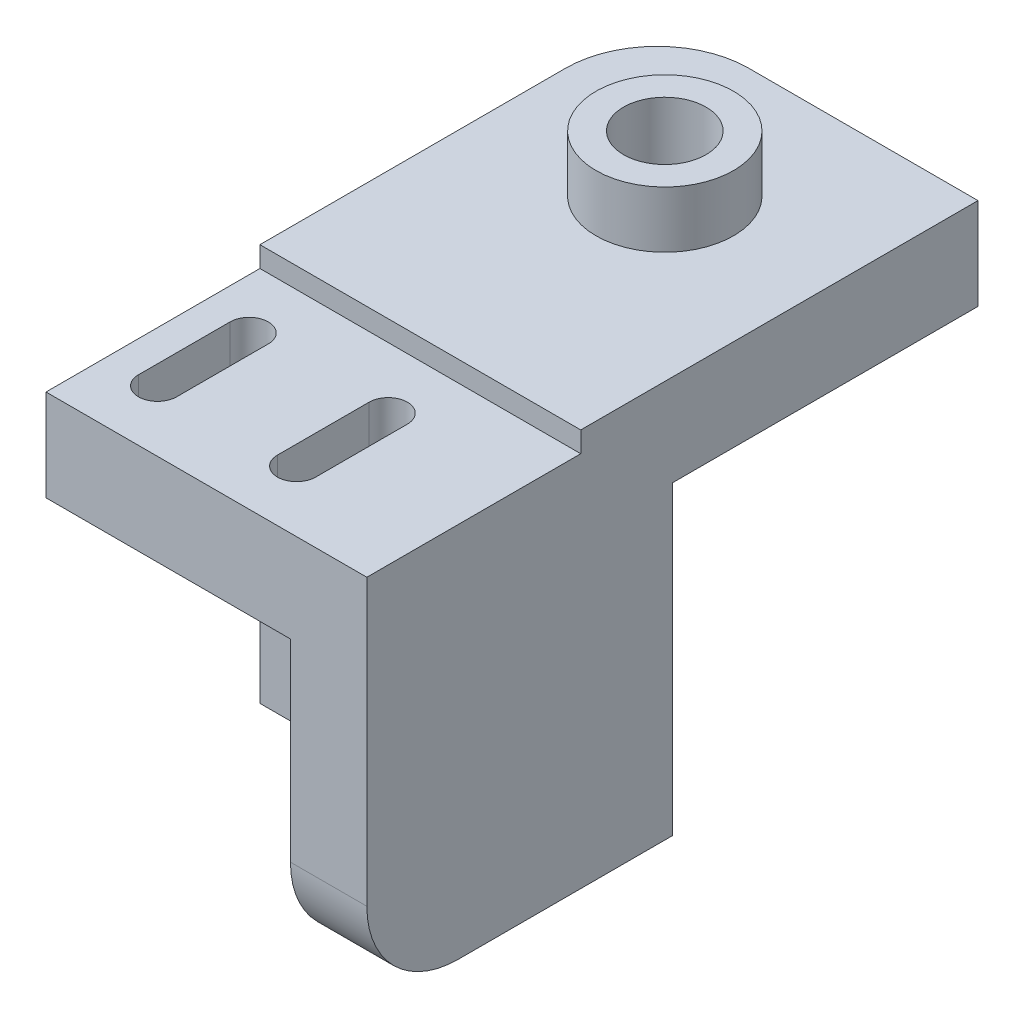
ISO-10303-21;
HEADER;
FILE_DESCRIPTION(('STEP AP214'),'2;1');
FILE_NAME('part.step','',(''),(''),'','','');
FILE_SCHEMA(('AUTOMOTIVE_DESIGN { 1 0 10303 214 1 1 1 1 }'));
ENDSEC;
DATA;
#1=APPLICATION_CONTEXT('core data for automotive mechanical design processes');
#2=APPLICATION_PROTOCOL_DEFINITION('international standard','automotive_design',2000,#1);
#3=PRODUCT_CONTEXT('',#1,'mechanical');
#4=PRODUCT('Part','Part','',(#3));
#5=PRODUCT_RELATED_PRODUCT_CATEGORY('part','',(#4));
#6=PRODUCT_DEFINITION_FORMATION('','',#4);
#7=PRODUCT_DEFINITION_CONTEXT('part definition',#1,'design');
#8=PRODUCT_DEFINITION('design','',#6,#7);
#9=PRODUCT_DEFINITION_SHAPE('','',#8);
#10=(LENGTH_UNIT() NAMED_UNIT(*) SI_UNIT(.MILLI.,.METRE.));
#11=(NAMED_UNIT(*) PLANE_ANGLE_UNIT() SI_UNIT($,.RADIAN.));
#12=(NAMED_UNIT(*) SI_UNIT($,.STERADIAN.) SOLID_ANGLE_UNIT());
#13=UNCERTAINTY_MEASURE_WITH_UNIT(LENGTH_MEASURE(1.E-05),#10,'distance_accuracy_value','');
#14=(GEOMETRIC_REPRESENTATION_CONTEXT(3) GLOBAL_UNCERTAINTY_ASSIGNED_CONTEXT((#13)) GLOBAL_UNIT_ASSIGNED_CONTEXT((#10,
#11,#12)) REPRESENTATION_CONTEXT('',''));
#15=CARTESIAN_POINT('',(0.,0.,0.));
#16=DIRECTION('',(0.,0.,1.));
#17=DIRECTION('',(1.,0.,0.));
#18=AXIS2_PLACEMENT_3D('',#15,#16,#17);
#19=CARTESIAN_POINT('',(0.,0.,6.));
#20=DIRECTION('',(0.,0.,1.));
#21=DIRECTION('',(1.,0.,0.));
#22=AXIS2_PLACEMENT_3D('',#19,#20,#21);
#23=PLANE('',#22);
#24=CARTESIAN_POINT('',(8.,10.,6.));
#25=DIRECTION('',(0.,0.,1.));
#26=DIRECTION('',(1.,0.,0.));
#27=AXIS2_PLACEMENT_3D('',#24,#25,#26);
#28=CIRCLE('',#27,2.7);
#29=CARTESIAN_POINT('',(10.7,10.,6.));
#30=VERTEX_POINT('',#29);
#31=EDGE_CURVE('E283',#30,#30,#28,.T.);
#32=ORIENTED_EDGE('',*,*,#31,.F.);
#33=EDGE_LOOP('',(#32));
#34=FACE_BOUND('',#33,.T.);
#35=DIRECTION('',(1.,0.,0.));
#36=VECTOR('',#35,1.);
#37=CARTESIAN_POINT('',(0.,0.,6.));
#38=LINE('',#37,#36);
#39=CARTESIAN_POINT('',(0.,0.,6.));
#40=VERTEX_POINT('',#39);
#41=CARTESIAN_POINT('',(16.,0.,6.));
#42=VERTEX_POINT('',#41);
#43=EDGE_CURVE('E270',#40,#42,#38,.T.);
#44=ORIENTED_EDGE('',*,*,#43,.T.);
#45=DIRECTION('',(0.,-1.,0.));
#46=VECTOR('',#45,1.);
#47=CARTESIAN_POINT('',(16.,0.,6.));
#48=LINE('',#47,#46);
#49=CARTESIAN_POINT('',(16.,18.65,6.));
#50=VERTEX_POINT('',#49);
#51=EDGE_CURVE('E189',#50,#42,#48,.T.);
#52=ORIENTED_EDGE('',*,*,#51,.F.);
#53=DIRECTION('',(1.,0.,0.));
#54=VECTOR('',#53,1.);
#55=CARTESIAN_POINT('',(0.,18.65,6.));
#56=LINE('',#55,#54);
#57=CARTESIAN_POINT('',(0.,18.65,6.));
#58=VERTEX_POINT('',#57);
#59=EDGE_CURVE('E197',#58,#50,#56,.T.);
#60=ORIENTED_EDGE('',*,*,#59,.F.);
#61=DIRECTION('',(0.,1.,0.));
#62=VECTOR('',#61,1.);
#63=CARTESIAN_POINT('',(0.,0.,6.));
#64=LINE('',#63,#62);
#65=EDGE_CURVE('E267',#40,#58,#64,.T.);
#66=ORIENTED_EDGE('',*,*,#65,.F.);
#67=EDGE_LOOP('',(#44,#52,#60,#66));
#68=FACE_BOUND('',#67,.T.);
#69=ADVANCED_FACE('F37',(#34,#68),#23,.T.);
#70=CARTESIAN_POINT('',(0.,18.65,20.));
#71=DIRECTION('',(0.,1.,0.));
#72=DIRECTION('',(0.,0.,1.));
#73=AXIS2_PLACEMENT_3D('',#70,#71,#72);
#74=PLANE('',#73);
#75=DIRECTION('',(0.,0.,1.));
#76=VECTOR('',#75,1.);
#77=CARTESIAN_POINT('',(2.05,18.65,20.));
#78=LINE('',#77,#76);
#79=CARTESIAN_POINT('',(2.05,18.65,10.));
#80=VERTEX_POINT('',#79);
#81=CARTESIAN_POINT('',(2.05,18.65,16.));
#82=VERTEX_POINT('',#81);
#83=EDGE_CURVE('E411',#80,#82,#78,.T.);
#84=ORIENTED_EDGE('',*,*,#83,.T.);
#85=CARTESIAN_POINT('',(3.3,18.65,16.));
#86=DIRECTION('',(0.,1.,0.));
#87=DIRECTION('',(0.,0.,1.));
#88=AXIS2_PLACEMENT_3D('',#85,#86,#87);
#89=CIRCLE('',#88,1.25);
#90=CARTESIAN_POINT('',(4.55,18.65,16.));
#91=VERTEX_POINT('',#90);
#92=EDGE_CURVE('E221',#82,#91,#89,.T.);
#93=ORIENTED_EDGE('',*,*,#92,.T.);
#94=DIRECTION('',(0.,0.,-1.));
#95=VECTOR('',#94,1.);
#96=CARTESIAN_POINT('',(4.55,18.65,20.));
#97=LINE('',#96,#95);
#98=CARTESIAN_POINT('',(4.55,18.65,10.));
#99=VERTEX_POINT('',#98);
#100=EDGE_CURVE('E399',#91,#99,#97,.T.);
#101=ORIENTED_EDGE('',*,*,#100,.T.);
#102=CARTESIAN_POINT('',(3.3,18.65,10.));
#103=DIRECTION('',(0.,1.,0.));
#104=DIRECTION('',(0.,0.,1.));
#105=AXIS2_PLACEMENT_3D('',#102,#103,#104);
#106=CIRCLE('',#105,1.25);
#107=EDGE_CURVE('E408',#99,#80,#106,.T.);
#108=ORIENTED_EDGE('',*,*,#107,.T.);
#109=EDGE_LOOP('',(#84,#93,#101,#108));
#110=FACE_BOUND('',#109,.T.);
#111=DIRECTION('',(0.,0.,1.));
#112=VECTOR('',#111,1.);
#113=CARTESIAN_POINT('',(11.15,18.65,20.));
#114=LINE('',#113,#112);
#115=CARTESIAN_POINT('',(11.15,18.65,10.));
#116=VERTEX_POINT('',#115);
#117=CARTESIAN_POINT('',(11.15,18.65,16.));
#118=VERTEX_POINT('',#117);
#119=EDGE_CURVE('E379',#116,#118,#114,.T.);
#120=ORIENTED_EDGE('',*,*,#119,.T.);
#121=CARTESIAN_POINT('',(12.4,18.65,16.));
#122=DIRECTION('',(0.,1.,0.));
#123=DIRECTION('',(0.,0.,1.));
#124=AXIS2_PLACEMENT_3D('',#121,#122,#123);
#125=CIRCLE('',#124,1.25);
#126=CARTESIAN_POINT('',(13.65,18.65,16.));
#127=VERTEX_POINT('',#126);
#128=EDGE_CURVE('E382',#118,#127,#125,.T.);
#129=ORIENTED_EDGE('',*,*,#128,.T.);
#130=DIRECTION('',(0.,0.,-1.));
#131=VECTOR('',#130,1.);
#132=CARTESIAN_POINT('',(13.65,18.65,20.));
#133=LINE('',#132,#131);
#134=CARTESIAN_POINT('',(13.65,18.65,10.));
#135=VERTEX_POINT('',#134);
#136=EDGE_CURVE('E367',#127,#135,#133,.T.);
#137=ORIENTED_EDGE('',*,*,#136,.T.);
#138=CARTESIAN_POINT('',(12.4,18.65,10.));
#139=DIRECTION('',(0.,1.,0.));
#140=DIRECTION('',(0.,0.,1.));
#141=AXIS2_PLACEMENT_3D('',#138,#139,#140);
#142=CIRCLE('',#141,1.25);
#143=EDGE_CURVE('E376',#135,#116,#142,.T.);
#144=ORIENTED_EDGE('',*,*,#143,.T.);
#145=EDGE_LOOP('',(#120,#129,#137,#144));
#146=FACE_BOUND('',#145,.T.);
#147=DIRECTION('',(0.,0.,-1.));
#148=VECTOR('',#147,1.);
#149=CARTESIAN_POINT('',(16.,18.65,20.));
#150=LINE('',#149,#148);
#151=CARTESIAN_POINT('',(16.,18.65,20.));
#152=VERTEX_POINT('',#151);
#153=EDGE_CURVE('E181',#152,#50,#150,.T.);
#154=ORIENTED_EDGE('',*,*,#153,.F.);
#155=DIRECTION('',(1.,0.,0.));
#156=VECTOR('',#155,1.);
#157=CARTESIAN_POINT('',(0.,18.65,20.));
#158=LINE('',#157,#156);
#159=CARTESIAN_POINT('',(0.,18.65,20.));
#160=VERTEX_POINT('',#159);
#161=EDGE_CURVE('E195',#160,#152,#158,.T.);
#162=ORIENTED_EDGE('',*,*,#161,.F.);
#163=DIRECTION('',(0.,0.,-1.));
#164=VECTOR('',#163,1.);
#165=CARTESIAN_POINT('',(0.,18.65,20.));
#166=LINE('',#165,#164);
#167=EDGE_CURVE('E225',#160,#58,#166,.T.);
#168=ORIENTED_EDGE('',*,*,#167,.T.);
#169=ORIENTED_EDGE('',*,*,#59,.T.);
#170=EDGE_LOOP('',(#154,#162,#168,#169));
#171=FACE_BOUND('',#170,.T.);
#172=ADVANCED_FACE('F193',(#110,#146,#171),#74,.F.);
#173=CARTESIAN_POINT('',(0.,26.,6.));
#174=DIRECTION('',(0.,1.,0.));
#175=DIRECTION('',(0.,0.,1.));
#176=AXIS2_PLACEMENT_3D('',#173,#174,#175);
#177=PLANE('',#176);
#178=DIRECTION('',(1.,0.,0.));
#179=VECTOR('',#178,1.);
#180=CARTESIAN_POINT('',(21.,26.,-20.));
#181=LINE('',#180,#179);
#182=CARTESIAN_POINT('',(6.,26.,-20.));
#183=VERTEX_POINT('',#182);
#184=CARTESIAN_POINT('',(21.,26.,-20.));
#185=VERTEX_POINT('',#184);
#186=EDGE_CURVE('E252',#183,#185,#181,.T.);
#187=ORIENTED_EDGE('',*,*,#186,.F.);
#188=CARTESIAN_POINT('',(6.,26.,-14.));
#189=DIRECTION('',(0.,1.,0.));
#190=DIRECTION('',(0.,0.,1.));
#191=AXIS2_PLACEMENT_3D('',#188,#189,#190);
#192=CIRCLE('',#191,6.);
#193=CARTESIAN_POINT('',(0.,26.,-14.));
#194=VERTEX_POINT('',#193);
#195=EDGE_CURVE('E244',#183,#194,#192,.T.);
#196=ORIENTED_EDGE('',*,*,#195,.T.);
#197=DIRECTION('',(0.,0.,-1.));
#198=VECTOR('',#197,1.);
#199=CARTESIAN_POINT('',(0.,26.,6.));
#200=LINE('',#199,#198);
#201=CARTESIAN_POINT('',(0.,26.,6.));
#202=VERTEX_POINT('',#201);
#203=EDGE_CURVE('E286',#202,#194,#200,.T.);
#204=ORIENTED_EDGE('',*,*,#203,.F.);
#205=DIRECTION('',(1.,0.,0.));
#206=VECTOR('',#205,1.);
#207=CARTESIAN_POINT('',(0.,26.,6.));
#208=LINE('',#207,#206);
#209=CARTESIAN_POINT('',(21.,26.,6.));
#210=VERTEX_POINT('',#209);
#211=EDGE_CURVE('E280',#202,#210,#208,.T.);
#212=ORIENTED_EDGE('',*,*,#211,.T.);
#213=DIRECTION('',(0.,0.,-1.));
#214=VECTOR('',#213,1.);
#215=CARTESIAN_POINT('',(21.,26.,6.));
#216=LINE('',#215,#214);
#217=EDGE_CURVE('E304',#210,#185,#216,.T.);
#218=ORIENTED_EDGE('',*,*,#217,.T.);
#219=EDGE_LOOP('',(#187,#196,#204,#212,#218));
#220=FACE_BOUND('',#219,.T.);
#221=CARTESIAN_POINT('',(10.5,26.,-10.));
#222=DIRECTION('',(0.,1.,0.));
#223=DIRECTION('',(0.,0.,1.));
#224=AXIS2_PLACEMENT_3D('',#221,#222,#223);
#225=CIRCLE('',#224,4.5);
#226=CARTESIAN_POINT('',(10.5,26.,-5.5));
#227=VERTEX_POINT('',#226);
#228=EDGE_CURVE('E347',#227,#227,#225,.T.);
#229=ORIENTED_EDGE('',*,*,#228,.F.);
#230=EDGE_LOOP('',(#229));
#231=FACE_BOUND('',#230,.T.);
#232=ADVANCED_FACE('F449',(#220,#231),#177,.T.);
#233=DIRECTION('',(-1.,0.,0.));
#234=VECTOR('',#233,1.);
#235=CARTESIAN_POINT('',(0.,24.65,6.));
#236=LINE('',#235,#234);
#237=CARTESIAN_POINT('',(21.,24.65,6.));
#238=VERTEX_POINT('',#237);
#239=CARTESIAN_POINT('',(0.,24.65,6.));
#240=VERTEX_POINT('',#239);
#241=EDGE_CURVE('E208',#238,#240,#236,.T.);
#242=ORIENTED_EDGE('',*,*,#241,.F.);
#243=DIRECTION('',(0.,1.,0.));
#244=VECTOR('',#243,1.);
#245=CARTESIAN_POINT('',(21.,0.,6.));
#246=LINE('',#245,#244);
#247=EDGE_CURVE('E222',#238,#210,#246,.T.);
#248=ORIENTED_EDGE('',*,*,#247,.T.);
#249=ORIENTED_EDGE('',*,*,#211,.F.);
#250=EDGE_CURVE('E271',#240,#202,#64,.T.);
#251=ORIENTED_EDGE('',*,*,#250,.F.);
#252=EDGE_LOOP('',(#242,#248,#249,#251));
#253=FACE_BOUND('',#252,.T.);
#254=ADVANCED_FACE('F445',(#253),#23,.T.);
#255=CARTESIAN_POINT('',(0.,0.,0.));
#256=DIRECTION('',(0.,0.,1.));
#257=DIRECTION('',(1.,0.,0.));
#258=AXIS2_PLACEMENT_3D('',#255,#256,#257);
#259=PLANE('',#258);
#260=CARTESIAN_POINT('',(8.,10.,0.));
#261=DIRECTION('',(0.,0.,1.));
#262=DIRECTION('',(1.,0.,0.));
#263=AXIS2_PLACEMENT_3D('',#260,#261,#262);
#264=CIRCLE('',#263,2.7);
#265=CARTESIAN_POINT('',(10.7,10.,0.));
#266=VERTEX_POINT('',#265);
#267=EDGE_CURVE('E297',#266,#266,#264,.T.);
#268=ORIENTED_EDGE('',*,*,#267,.T.);
#269=EDGE_LOOP('',(#268));
#270=FACE_BOUND('',#269,.T.);
#271=DIRECTION('',(-1.,0.,0.));
#272=VECTOR('',#271,1.);
#273=CARTESIAN_POINT('',(21.,20.,0.));
#274=LINE('',#273,#272);
#275=CARTESIAN_POINT('',(21.,20.,0.));
#276=VERTEX_POINT('',#275);
#277=CARTESIAN_POINT('',(0.,20.,0.));
#278=VERTEX_POINT('',#277);
#279=EDGE_CURVE('E257',#276,#278,#274,.T.);
#280=ORIENTED_EDGE('',*,*,#279,.F.);
#281=DIRECTION('',(0.,1.,0.));
#282=VECTOR('',#281,1.);
#283=CARTESIAN_POINT('',(21.,0.,0.));
#284=LINE('',#283,#282);
#285=CARTESIAN_POINT('',(21.,0.,0.));
#286=VERTEX_POINT('',#285);
#287=EDGE_CURVE('E295',#286,#276,#284,.T.);
#288=ORIENTED_EDGE('',*,*,#287,.F.);
#289=DIRECTION('',(1.,0.,0.));
#290=VECTOR('',#289,1.);
#291=CARTESIAN_POINT('',(0.,0.,0.));
#292=LINE('',#291,#290);
#293=CARTESIAN_POINT('',(0.,0.,0.));
#294=VERTEX_POINT('',#293);
#295=EDGE_CURVE('E289',#294,#286,#292,.T.);
#296=ORIENTED_EDGE('',*,*,#295,.F.);
#297=DIRECTION('',(0.,1.,0.));
#298=VECTOR('',#297,1.);
#299=CARTESIAN_POINT('',(0.,0.,0.));
#300=LINE('',#299,#298);
#301=EDGE_CURVE('E262',#294,#278,#300,.T.);
#302=ORIENTED_EDGE('',*,*,#301,.T.);
#303=EDGE_LOOP('',(#280,#288,#296,#302));
#304=FACE_BOUND('',#303,.T.);
#305=ADVANCED_FACE('F316',(#270,#304),#259,.F.);
#306=CARTESIAN_POINT('',(0.,0.,6.));
#307=DIRECTION('',(-1.,0.,0.));
#308=DIRECTION('',(0.,0.,1.));
#309=AXIS2_PLACEMENT_3D('',#306,#307,#308);
#310=PLANE('',#309);
#311=ORIENTED_EDGE('',*,*,#203,.T.);
#312=DIRECTION('',(0.,1.,0.));
#313=VECTOR('',#312,1.);
#314=CARTESIAN_POINT('',(0.,0.,-14.));
#315=LINE('',#314,#313);
#316=CARTESIAN_POINT('',(0.,20.,-14.));
#317=VERTEX_POINT('',#316);
#318=EDGE_CURVE('E247',#194,#317,#315,.F.);
#319=ORIENTED_EDGE('',*,*,#318,.T.);
#320=DIRECTION('',(0.,0.,1.));
#321=VECTOR('',#320,1.);
#322=CARTESIAN_POINT('',(0.,20.,-20.));
#323=LINE('',#322,#321);
#324=EDGE_CURVE('E248',#317,#278,#323,.T.);
#325=ORIENTED_EDGE('',*,*,#324,.T.);
#326=ORIENTED_EDGE('',*,*,#301,.F.);
#327=DIRECTION('',(0.,0.,-1.));
#328=VECTOR('',#327,1.);
#329=CARTESIAN_POINT('',(0.,0.,6.));
#330=LINE('',#329,#328);
#331=EDGE_CURVE('E245',#40,#294,#330,.T.);
#332=ORIENTED_EDGE('',*,*,#331,.F.);
#333=ORIENTED_EDGE('',*,*,#65,.T.);
#334=ORIENTED_EDGE('',*,*,#167,.F.);
#335=DIRECTION('',(0.,-1.,0.));
#336=VECTOR('',#335,1.);
#337=CARTESIAN_POINT('',(0.,18.65,20.));
#338=LINE('',#337,#336);
#339=CARTESIAN_POINT('',(0.,24.65,20.));
#340=VERTEX_POINT('',#339);
#341=EDGE_CURVE('E202',#340,#160,#338,.T.);
#342=ORIENTED_EDGE('',*,*,#341,.F.);
#343=DIRECTION('',(0.,0.,-1.));
#344=VECTOR('',#343,1.);
#345=CARTESIAN_POINT('',(0.,24.65,20.));
#346=LINE('',#345,#344);
#347=EDGE_CURVE('E213',#340,#240,#346,.T.);
#348=ORIENTED_EDGE('',*,*,#347,.T.);
#349=ORIENTED_EDGE('',*,*,#250,.T.);
#350=EDGE_LOOP('',(#311,#319,#325,#326,#332,#333,#334,#342,#348,#349));
#351=FACE_BOUND('',#350,.T.);
#352=ADVANCED_FACE('F318',(#351),#310,.T.);
#353=CARTESIAN_POINT('',(0.,0.,6.));
#354=DIRECTION('',(0.,1.,0.));
#355=DIRECTION('',(0.,0.,1.));
#356=AXIS2_PLACEMENT_3D('',#353,#354,#355);
#357=PLANE('',#356);
#358=DIRECTION('',(0.,0.,-1.));
#359=VECTOR('',#358,1.);
#360=CARTESIAN_POINT('',(21.,0.,6.));
#361=LINE('',#360,#359);
#362=CARTESIAN_POINT('',(21.,0.,14.));
#363=VERTEX_POINT('',#362);
#364=EDGE_CURVE('E306',#363,#286,#361,.T.);
#365=ORIENTED_EDGE('',*,*,#364,.F.);
#366=DIRECTION('',(1.,0.,0.));
#367=VECTOR('',#366,1.);
#368=CARTESIAN_POINT('',(0.,0.,14.));
#369=LINE('',#368,#367);
#370=CARTESIAN_POINT('',(16.,0.,14.));
#371=VERTEX_POINT('',#370);
#372=EDGE_CURVE('E45',#363,#371,#369,.F.);
#373=ORIENTED_EDGE('',*,*,#372,.T.);
#374=DIRECTION('',(0.,0.,-1.));
#375=VECTOR('',#374,1.);
#376=CARTESIAN_POINT('',(16.,0.,20.));
#377=LINE('',#376,#375);
#378=EDGE_CURVE('E188',#371,#42,#377,.T.);
#379=ORIENTED_EDGE('',*,*,#378,.T.);
#380=ORIENTED_EDGE('',*,*,#43,.F.);
#381=ORIENTED_EDGE('',*,*,#331,.T.);
#382=ORIENTED_EDGE('',*,*,#295,.T.);
#383=EDGE_LOOP('',(#365,#373,#379,#380,#381,#382));
#384=FACE_BOUND('',#383,.T.);
#385=ADVANCED_FACE('F310',(#384),#357,.F.);
#386=CARTESIAN_POINT('',(21.,0.,6.));
#387=DIRECTION('',(-1.,0.,0.));
#388=DIRECTION('',(0.,0.,1.));
#389=AXIS2_PLACEMENT_3D('',#386,#387,#388);
#390=PLANE('',#389);
#391=DIRECTION('',(0.,1.,0.));
#392=VECTOR('',#391,1.);
#393=CARTESIAN_POINT('',(21.,18.65,20.));
#394=LINE('',#393,#392);
#395=CARTESIAN_POINT('',(21.,6.,20.));
#396=VERTEX_POINT('',#395);
#397=CARTESIAN_POINT('',(21.,24.65,20.));
#398=VERTEX_POINT('',#397);
#399=EDGE_CURVE('E204',#396,#398,#394,.T.);
#400=ORIENTED_EDGE('',*,*,#399,.F.);
#401=CARTESIAN_POINT('',(21.,6.,14.));
#402=DIRECTION('',(-1.,0.,0.));
#403=DIRECTION('',(0.,0.,1.));
#404=AXIS2_PLACEMENT_3D('',#401,#402,#403);
#405=CIRCLE('',#404,6.);
#406=EDGE_CURVE('E59',#396,#363,#405,.F.);
#407=ORIENTED_EDGE('',*,*,#406,.T.);
#408=ORIENTED_EDGE('',*,*,#364,.T.);
#409=ORIENTED_EDGE('',*,*,#287,.T.);
#410=DIRECTION('',(0.,0.,1.));
#411=VECTOR('',#410,1.);
#412=CARTESIAN_POINT('',(21.,20.,-20.));
#413=LINE('',#412,#411);
#414=CARTESIAN_POINT('',(21.,20.,-20.));
#415=VERTEX_POINT('',#414);
#416=EDGE_CURVE('E251',#415,#276,#413,.T.);
#417=ORIENTED_EDGE('',*,*,#416,.F.);
#418=DIRECTION('',(0.,-1.,0.));
#419=VECTOR('',#418,1.);
#420=CARTESIAN_POINT('',(21.,26.,-20.));
#421=LINE('',#420,#419);
#422=EDGE_CURVE('E472',#185,#415,#421,.T.);
#423=ORIENTED_EDGE('',*,*,#422,.F.);
#424=ORIENTED_EDGE('',*,*,#217,.F.);
#425=ORIENTED_EDGE('',*,*,#247,.F.);
#426=DIRECTION('',(0.,0.,-1.));
#427=VECTOR('',#426,1.);
#428=CARTESIAN_POINT('',(21.,24.65,20.));
#429=LINE('',#428,#427);
#430=EDGE_CURVE('E228',#398,#238,#429,.T.);
#431=ORIENTED_EDGE('',*,*,#430,.F.);
#432=EDGE_LOOP('',(#400,#407,#408,#409,#417,#423,#424,#425,#431));
#433=FACE_BOUND('',#432,.T.);
#434=ADVANCED_FACE('F334',(#433),#390,.F.);
#435=CARTESIAN_POINT('',(8.,10.,6.));
#436=DIRECTION('',(0.,0.,-1.));
#437=DIRECTION('',(-1.,0.,0.));
#438=AXIS2_PLACEMENT_3D('',#435,#436,#437);
#439=CYLINDRICAL_SURFACE('',#438,2.7);
#440=ORIENTED_EDGE('',*,*,#31,.T.);
#441=EDGE_LOOP('',(#440));
#442=FACE_BOUND('',#441,.T.);
#443=ORIENTED_EDGE('',*,*,#267,.F.);
#444=EDGE_LOOP('',(#443));
#445=FACE_BOUND('',#444,.T.);
#446=ADVANCED_FACE('F484',(#442,#445),#439,.F.);
#447=CARTESIAN_POINT('',(21.,20.,-20.));
#448=DIRECTION('',(0.,1.,0.));
#449=DIRECTION('',(0.,0.,1.));
#450=AXIS2_PLACEMENT_3D('',#447,#448,#449);
#451=PLANE('',#450);
#452=CARTESIAN_POINT('',(10.5,20.,-10.));
#453=DIRECTION('',(0.,1.,0.));
#454=DIRECTION('',(0.,0.,1.));
#455=AXIS2_PLACEMENT_3D('',#452,#453,#454);
#456=CIRCLE('',#455,2.7);
#457=CARTESIAN_POINT('',(10.5,20.,-7.3));
#458=VERTEX_POINT('',#457);
#459=EDGE_CURVE('E227',#458,#458,#456,.T.);
#460=ORIENTED_EDGE('',*,*,#459,.T.);
#461=EDGE_LOOP('',(#460));
#462=FACE_BOUND('',#461,.T.);
#463=ORIENTED_EDGE('',*,*,#324,.F.);
#464=CARTESIAN_POINT('',(6.,20.,-14.));
#465=DIRECTION('',(0.,1.,0.));
#466=DIRECTION('',(0.,0.,1.));
#467=AXIS2_PLACEMENT_3D('',#464,#465,#466);
#468=CIRCLE('',#467,6.);
#469=CARTESIAN_POINT('',(6.,20.,-20.));
#470=VERTEX_POINT('',#469);
#471=EDGE_CURVE('E324',#317,#470,#468,.F.);
#472=ORIENTED_EDGE('',*,*,#471,.T.);
#473=DIRECTION('',(-1.,0.,0.));
#474=VECTOR('',#473,1.);
#475=CARTESIAN_POINT('',(21.,20.,-20.));
#476=LINE('',#475,#474);
#477=EDGE_CURVE('E470',#415,#470,#476,.T.);
#478=ORIENTED_EDGE('',*,*,#477,.F.);
#479=ORIENTED_EDGE('',*,*,#416,.T.);
#480=ORIENTED_EDGE('',*,*,#279,.T.);
#481=EDGE_LOOP('',(#463,#472,#478,#479,#480));
#482=FACE_BOUND('',#481,.T.);
#483=ADVANCED_FACE('F323',(#462,#482),#451,.F.);
#484=CARTESIAN_POINT('',(0.,0.,-20.));
#485=DIRECTION('',(0.,0.,-1.));
#486=DIRECTION('',(-1.,0.,0.));
#487=AXIS2_PLACEMENT_3D('',#484,#485,#486);
#488=PLANE('',#487);
#489=ORIENTED_EDGE('',*,*,#477,.T.);
#490=DIRECTION('',(0.,1.,0.));
#491=VECTOR('',#490,1.);
#492=CARTESIAN_POINT('',(6.,0.,-20.));
#493=LINE('',#492,#491);
#494=EDGE_CURVE('E241',#470,#183,#493,.T.);
#495=ORIENTED_EDGE('',*,*,#494,.T.);
#496=ORIENTED_EDGE('',*,*,#186,.T.);
#497=ORIENTED_EDGE('',*,*,#422,.T.);
#498=EDGE_LOOP('',(#489,#495,#496,#497));
#499=FACE_BOUND('',#498,.T.);
#500=ADVANCED_FACE('F468',(#499),#488,.T.);
#501=CARTESIAN_POINT('',(10.5,17.,-10.));
#502=DIRECTION('',(0.,1.,0.));
#503=DIRECTION('',(0.,0.,1.));
#504=AXIS2_PLACEMENT_3D('',#501,#502,#503);
#505=CYLINDRICAL_SURFACE('',#504,2.7);
#506=ORIENTED_EDGE('',*,*,#459,.F.);
#507=EDGE_LOOP('',(#506));
#508=FACE_BOUND('',#507,.T.);
#509=CARTESIAN_POINT('',(10.5,29.7,-10.));
#510=DIRECTION('',(0.,1.,0.));
#511=DIRECTION('',(0.,0.,1.));
#512=AXIS2_PLACEMENT_3D('',#509,#510,#511);
#513=CIRCLE('',#512,2.7);
#514=CARTESIAN_POINT('',(10.5,29.7,-7.3));
#515=VERTEX_POINT('',#514);
#516=EDGE_CURVE('E198',#515,#515,#513,.T.);
#517=ORIENTED_EDGE('',*,*,#516,.T.);
#518=EDGE_LOOP('',(#517));
#519=FACE_BOUND('',#518,.T.);
#520=ADVANCED_FACE('F476',(#508,#519),#505,.F.);
#521=CARTESIAN_POINT('',(0.,24.65,20.));
#522=DIRECTION('',(0.,-1.,0.));
#523=DIRECTION('',(0.,0.,-1.));
#524=AXIS2_PLACEMENT_3D('',#521,#522,#523);
#525=PLANE('',#524);
#526=DIRECTION('',(0.,0.,-1.));
#527=VECTOR('',#526,1.);
#528=CARTESIAN_POINT('',(13.65,24.65,16.));
#529=LINE('',#528,#527);
#530=CARTESIAN_POINT('',(13.65,24.65,16.));
#531=VERTEX_POINT('',#530);
#532=CARTESIAN_POINT('',(13.65,24.65,10.));
#533=VERTEX_POINT('',#532);
#534=EDGE_CURVE('E355',#531,#533,#529,.T.);
#535=ORIENTED_EDGE('',*,*,#534,.F.);
#536=CARTESIAN_POINT('',(12.4,24.65,16.));
#537=DIRECTION('',(0.,1.,0.));
#538=DIRECTION('',(0.,0.,-1.));
#539=AXIS2_PLACEMENT_3D('',#536,#537,#538);
#540=CIRCLE('',#539,1.25);
#541=CARTESIAN_POINT('',(11.15,24.65,16.));
#542=VERTEX_POINT('',#541);
#543=EDGE_CURVE('E351',#542,#531,#540,.T.);
#544=ORIENTED_EDGE('',*,*,#543,.F.);
#545=DIRECTION('',(0.,0.,1.));
#546=VECTOR('',#545,1.);
#547=CARTESIAN_POINT('',(11.15,24.65,16.));
#548=LINE('',#547,#546);
#549=CARTESIAN_POINT('',(11.15,24.65,10.));
#550=VERTEX_POINT('',#549);
#551=EDGE_CURVE('E361',#550,#542,#548,.T.);
#552=ORIENTED_EDGE('',*,*,#551,.F.);
#553=CARTESIAN_POINT('',(12.4,24.65,10.));
#554=DIRECTION('',(0.,1.,0.));
#555=DIRECTION('',(0.,0.,-1.));
#556=AXIS2_PLACEMENT_3D('',#553,#554,#555);
#557=CIRCLE('',#556,1.25);
#558=EDGE_CURVE('E358',#533,#550,#557,.T.);
#559=ORIENTED_EDGE('',*,*,#558,.F.);
#560=EDGE_LOOP('',(#535,#544,#552,#559));
#561=FACE_BOUND('',#560,.T.);
#562=DIRECTION('',(0.,0.,-1.));
#563=VECTOR('',#562,1.);
#564=CARTESIAN_POINT('',(4.55,24.65,16.));
#565=LINE('',#564,#563);
#566=CARTESIAN_POINT('',(4.55,24.65,16.));
#567=VERTEX_POINT('',#566);
#568=CARTESIAN_POINT('',(4.55,24.65,10.));
#569=VERTEX_POINT('',#568);
#570=EDGE_CURVE('E387',#567,#569,#565,.T.);
#571=ORIENTED_EDGE('',*,*,#570,.F.);
#572=CARTESIAN_POINT('',(3.3,24.65,16.));
#573=DIRECTION('',(0.,1.,0.));
#574=DIRECTION('',(0.,0.,1.));
#575=AXIS2_PLACEMENT_3D('',#572,#573,#574);
#576=CIRCLE('',#575,1.25);
#577=CARTESIAN_POINT('',(2.05,24.65,16.));
#578=VERTEX_POINT('',#577);
#579=EDGE_CURVE('E385',#578,#567,#576,.T.);
#580=ORIENTED_EDGE('',*,*,#579,.F.);
#581=DIRECTION('',(0.,0.,1.));
#582=VECTOR('',#581,1.);
#583=CARTESIAN_POINT('',(2.05,24.65,16.));
#584=LINE('',#583,#582);
#585=CARTESIAN_POINT('',(2.05,24.65,10.));
#586=VERTEX_POINT('',#585);
#587=EDGE_CURVE('E393',#586,#578,#584,.T.);
#588=ORIENTED_EDGE('',*,*,#587,.F.);
#589=CARTESIAN_POINT('',(3.3,24.65,10.));
#590=DIRECTION('',(0.,1.,0.));
#591=DIRECTION('',(0.,0.,1.));
#592=AXIS2_PLACEMENT_3D('',#589,#590,#591);
#593=CIRCLE('',#592,1.25);
#594=EDGE_CURVE('E390',#569,#586,#593,.T.);
#595=ORIENTED_EDGE('',*,*,#594,.F.);
#596=EDGE_LOOP('',(#571,#580,#588,#595));
#597=FACE_BOUND('',#596,.T.);
#598=ORIENTED_EDGE('',*,*,#241,.T.);
#599=ORIENTED_EDGE('',*,*,#347,.F.);
#600=DIRECTION('',(-1.,0.,0.));
#601=VECTOR('',#600,1.);
#602=CARTESIAN_POINT('',(0.,24.65,20.));
#603=LINE('',#602,#601);
#604=EDGE_CURVE('E206',#398,#340,#603,.T.);
#605=ORIENTED_EDGE('',*,*,#604,.F.);
#606=ORIENTED_EDGE('',*,*,#430,.T.);
#607=EDGE_LOOP('',(#598,#599,#605,#606));
#608=FACE_BOUND('',#607,.T.);
#609=ADVANCED_FACE('F340',(#561,#597,#608),#525,.F.);
#610=CARTESIAN_POINT('',(0.,0.,20.));
#611=DIRECTION('',(0.,0.,-1.));
#612=DIRECTION('',(-1.,0.,0.));
#613=AXIS2_PLACEMENT_3D('',#610,#611,#612);
#614=PLANE('',#613);
#615=DIRECTION('',(0.,-1.,0.));
#616=VECTOR('',#615,1.);
#617=CARTESIAN_POINT('',(16.,0.,20.));
#618=LINE('',#617,#616);
#619=CARTESIAN_POINT('',(16.,6.,20.));
#620=VERTEX_POINT('',#619);
#621=EDGE_CURVE('E177',#152,#620,#618,.T.);
#622=ORIENTED_EDGE('',*,*,#621,.T.);
#623=DIRECTION('',(1.,0.,0.));
#624=VECTOR('',#623,1.);
#625=CARTESIAN_POINT('',(0.,6.,20.));
#626=LINE('',#625,#624);
#627=EDGE_CURVE('E329',#620,#396,#626,.T.);
#628=ORIENTED_EDGE('',*,*,#627,.T.);
#629=ORIENTED_EDGE('',*,*,#399,.T.);
#630=ORIENTED_EDGE('',*,*,#604,.T.);
#631=ORIENTED_EDGE('',*,*,#341,.T.);
#632=ORIENTED_EDGE('',*,*,#161,.T.);
#633=EDGE_LOOP('',(#622,#628,#629,#630,#631,#632));
#634=FACE_BOUND('',#633,.T.);
#635=ADVANCED_FACE('F200',(#634),#614,.F.);
#636=CARTESIAN_POINT('',(3.3,-15.4,16.));
#637=DIRECTION('',(0.,1.,0.));
#638=DIRECTION('',(0.,0.,1.));
#639=AXIS2_PLACEMENT_3D('',#636,#637,#638);
#640=CYLINDRICAL_SURFACE('',#639,1.25);
#641=DIRECTION('',(0.,1.,0.));
#642=VECTOR('',#641,1.);
#643=CARTESIAN_POINT('',(2.05,-15.4,16.));
#644=LINE('',#643,#642);
#645=EDGE_CURVE('E397',#82,#578,#644,.T.);
#646=ORIENTED_EDGE('',*,*,#645,.T.);
#647=ORIENTED_EDGE('',*,*,#579,.T.);
#648=DIRECTION('',(0.,1.,0.));
#649=VECTOR('',#648,1.);
#650=CARTESIAN_POINT('',(4.55,-15.4,16.));
#651=LINE('',#650,#649);
#652=EDGE_CURVE('E396',#91,#567,#651,.T.);
#653=ORIENTED_EDGE('',*,*,#652,.F.);
#654=ORIENTED_EDGE('',*,*,#92,.F.);
#655=EDGE_LOOP('',(#646,#647,#653,#654));
#656=FACE_BOUND('',#655,.T.);
#657=ADVANCED_FACE('F419',(#656),#640,.F.);
#658=CARTESIAN_POINT('',(2.05,-15.4,16.));
#659=DIRECTION('',(-1.,0.,0.));
#660=DIRECTION('',(0.,0.,1.));
#661=AXIS2_PLACEMENT_3D('',#658,#659,#660);
#662=PLANE('',#661);
#663=DIRECTION('',(0.,1.,0.));
#664=VECTOR('',#663,1.);
#665=CARTESIAN_POINT('',(2.05,-15.4,10.));
#666=LINE('',#665,#664);
#667=EDGE_CURVE('E400',#80,#586,#666,.T.);
#668=ORIENTED_EDGE('',*,*,#667,.T.);
#669=ORIENTED_EDGE('',*,*,#587,.T.);
#670=ORIENTED_EDGE('',*,*,#645,.F.);
#671=ORIENTED_EDGE('',*,*,#83,.F.);
#672=EDGE_LOOP('',(#668,#669,#670,#671));
#673=FACE_BOUND('',#672,.T.);
#674=ADVANCED_FACE('F421',(#673),#662,.F.);
#675=CARTESIAN_POINT('',(3.3,-15.4,10.));
#676=DIRECTION('',(0.,1.,0.));
#677=DIRECTION('',(0.,0.,1.));
#678=AXIS2_PLACEMENT_3D('',#675,#676,#677);
#679=CYLINDRICAL_SURFACE('',#678,1.25);
#680=DIRECTION('',(0.,1.,0.));
#681=VECTOR('',#680,1.);
#682=CARTESIAN_POINT('',(4.55,-15.4,10.));
#683=LINE('',#682,#681);
#684=EDGE_CURVE('E402',#99,#569,#683,.T.);
#685=ORIENTED_EDGE('',*,*,#684,.T.);
#686=ORIENTED_EDGE('',*,*,#594,.T.);
#687=ORIENTED_EDGE('',*,*,#667,.F.);
#688=ORIENTED_EDGE('',*,*,#107,.F.);
#689=EDGE_LOOP('',(#685,#686,#687,#688));
#690=FACE_BOUND('',#689,.T.);
#691=ADVANCED_FACE('F432',(#690),#679,.F.);
#692=CARTESIAN_POINT('',(4.55,-15.4,16.));
#693=DIRECTION('',(1.,0.,0.));
#694=DIRECTION('',(0.,0.,-1.));
#695=AXIS2_PLACEMENT_3D('',#692,#693,#694);
#696=PLANE('',#695);
#697=ORIENTED_EDGE('',*,*,#652,.T.);
#698=ORIENTED_EDGE('',*,*,#570,.T.);
#699=ORIENTED_EDGE('',*,*,#684,.F.);
#700=ORIENTED_EDGE('',*,*,#100,.F.);
#701=EDGE_LOOP('',(#697,#698,#699,#700));
#702=FACE_BOUND('',#701,.T.);
#703=ADVANCED_FACE('F429',(#702),#696,.F.);
#704=CARTESIAN_POINT('',(12.4,-15.4,16.));
#705=DIRECTION('',(0.,1.,0.));
#706=DIRECTION('',(0.,0.,1.));
#707=AXIS2_PLACEMENT_3D('',#704,#705,#706);
#708=CYLINDRICAL_SURFACE('',#707,1.25);
#709=DIRECTION('',(0.,1.,0.));
#710=VECTOR('',#709,1.);
#711=CARTESIAN_POINT('',(11.15,-15.4,16.));
#712=LINE('',#711,#710);
#713=EDGE_CURVE('E365',#118,#542,#712,.T.);
#714=ORIENTED_EDGE('',*,*,#713,.T.);
#715=ORIENTED_EDGE('',*,*,#543,.T.);
#716=DIRECTION('',(0.,1.,0.));
#717=VECTOR('',#716,1.);
#718=CARTESIAN_POINT('',(13.65,-15.4,16.));
#719=LINE('',#718,#717);
#720=EDGE_CURVE('E364',#127,#531,#719,.T.);
#721=ORIENTED_EDGE('',*,*,#720,.F.);
#722=ORIENTED_EDGE('',*,*,#128,.F.);
#723=EDGE_LOOP('',(#714,#715,#721,#722));
#724=FACE_BOUND('',#723,.T.);
#725=ADVANCED_FACE('F439',(#724),#708,.F.);
#726=CARTESIAN_POINT('',(11.15,-15.4,16.));
#727=DIRECTION('',(-1.,0.,0.));
#728=DIRECTION('',(0.,0.,1.));
#729=AXIS2_PLACEMENT_3D('',#726,#727,#728);
#730=PLANE('',#729);
#731=DIRECTION('',(0.,1.,0.));
#732=VECTOR('',#731,1.);
#733=CARTESIAN_POINT('',(11.15,-15.4,10.));
#734=LINE('',#733,#732);
#735=EDGE_CURVE('E368',#116,#550,#734,.T.);
#736=ORIENTED_EDGE('',*,*,#735,.T.);
#737=ORIENTED_EDGE('',*,*,#551,.T.);
#738=ORIENTED_EDGE('',*,*,#713,.F.);
#739=ORIENTED_EDGE('',*,*,#119,.F.);
#740=EDGE_LOOP('',(#736,#737,#738,#739));
#741=FACE_BOUND('',#740,.T.);
#742=ADVANCED_FACE('F521',(#741),#730,.F.);
#743=CARTESIAN_POINT('',(12.4,-15.4,10.));
#744=DIRECTION('',(0.,1.,0.));
#745=DIRECTION('',(0.,0.,1.));
#746=AXIS2_PLACEMENT_3D('',#743,#744,#745);
#747=CYLINDRICAL_SURFACE('',#746,1.25);
#748=DIRECTION('',(0.,1.,0.));
#749=VECTOR('',#748,1.);
#750=CARTESIAN_POINT('',(13.65,-15.4,10.));
#751=LINE('',#750,#749);
#752=EDGE_CURVE('E370',#135,#533,#751,.T.);
#753=ORIENTED_EDGE('',*,*,#752,.T.);
#754=ORIENTED_EDGE('',*,*,#558,.T.);
#755=ORIENTED_EDGE('',*,*,#735,.F.);
#756=ORIENTED_EDGE('',*,*,#143,.F.);
#757=EDGE_LOOP('',(#753,#754,#755,#756));
#758=FACE_BOUND('',#757,.T.);
#759=ADVANCED_FACE('F531',(#758),#747,.F.);
#760=CARTESIAN_POINT('',(13.65,-15.4,16.));
#761=DIRECTION('',(1.,0.,0.));
#762=DIRECTION('',(0.,0.,-1.));
#763=AXIS2_PLACEMENT_3D('',#760,#761,#762);
#764=PLANE('',#763);
#765=ORIENTED_EDGE('',*,*,#720,.T.);
#766=ORIENTED_EDGE('',*,*,#534,.T.);
#767=ORIENTED_EDGE('',*,*,#752,.F.);
#768=ORIENTED_EDGE('',*,*,#136,.F.);
#769=EDGE_LOOP('',(#765,#766,#767,#768));
#770=FACE_BOUND('',#769,.T.);
#771=ADVANCED_FACE('F541',(#770),#764,.F.);
#772=CARTESIAN_POINT('',(10.5,29.7,-10.));
#773=DIRECTION('',(0.,1.,0.));
#774=DIRECTION('',(0.,0.,1.));
#775=AXIS2_PLACEMENT_3D('',#772,#773,#774);
#776=PLANE('',#775);
#777=CARTESIAN_POINT('',(10.5,29.7,-10.));
#778=DIRECTION('',(0.,1.,0.));
#779=DIRECTION('',(0.,0.,1.));
#780=AXIS2_PLACEMENT_3D('',#777,#778,#779);
#781=CIRCLE('',#780,4.5);
#782=CARTESIAN_POINT('',(10.5,29.7,-5.5));
#783=VERTEX_POINT('',#782);
#784=EDGE_CURVE('E348',#783,#783,#781,.T.);
#785=ORIENTED_EDGE('',*,*,#784,.T.);
#786=EDGE_LOOP('',(#785));
#787=FACE_BOUND('',#786,.T.);
#788=ORIENTED_EDGE('',*,*,#516,.F.);
#789=EDGE_LOOP('',(#788));
#790=FACE_BOUND('',#789,.T.);
#791=ADVANCED_FACE('F551',(#787,#790),#776,.T.);
#792=CARTESIAN_POINT('',(10.5,29.7,-10.));
#793=DIRECTION('',(0.,-1.,0.));
#794=DIRECTION('',(0.,0.,-1.));
#795=AXIS2_PLACEMENT_3D('',#792,#793,#794);
#796=CYLINDRICAL_SURFACE('',#795,4.5);
#797=ORIENTED_EDGE('',*,*,#784,.F.);
#798=EDGE_LOOP('',(#797));
#799=FACE_BOUND('',#798,.T.);
#800=ORIENTED_EDGE('',*,*,#228,.T.);
#801=EDGE_LOOP('',(#800));
#802=FACE_BOUND('',#801,.T.);
#803=ADVANCED_FACE('F570',(#799,#802),#796,.T.);
#804=CARTESIAN_POINT('',(6.,0.,-14.));
#805=DIRECTION('',(0.,1.,0.));
#806=DIRECTION('',(0.,0.,1.));
#807=AXIS2_PLACEMENT_3D('',#804,#805,#806);
#808=CYLINDRICAL_SURFACE('',#807,6.);
#809=ORIENTED_EDGE('',*,*,#471,.F.);
#810=ORIENTED_EDGE('',*,*,#318,.F.);
#811=ORIENTED_EDGE('',*,*,#195,.F.);
#812=ORIENTED_EDGE('',*,*,#494,.F.);
#813=EDGE_LOOP('',(#809,#810,#811,#812));
#814=FACE_BOUND('',#813,.T.);
#815=ADVANCED_FACE('F328',(#814),#808,.T.);
#816=CARTESIAN_POINT('',(16.,0.,20.));
#817=DIRECTION('',(1.,0.,0.));
#818=DIRECTION('',(0.,0.,-1.));
#819=AXIS2_PLACEMENT_3D('',#816,#817,#818);
#820=PLANE('',#819);
#821=ORIENTED_EDGE('',*,*,#378,.F.);
#822=CARTESIAN_POINT('',(16.,6.,14.));
#823=DIRECTION('',(1.,0.,0.));
#824=DIRECTION('',(0.,0.,-1.));
#825=AXIS2_PLACEMENT_3D('',#822,#823,#824);
#826=CIRCLE('',#825,6.);
#827=EDGE_CURVE('E11',#371,#620,#826,.F.);
#828=ORIENTED_EDGE('',*,*,#827,.T.);
#829=ORIENTED_EDGE('',*,*,#621,.F.);
#830=ORIENTED_EDGE('',*,*,#153,.T.);
#831=ORIENTED_EDGE('',*,*,#51,.T.);
#832=EDGE_LOOP('',(#821,#828,#829,#830,#831));
#833=FACE_BOUND('',#832,.T.);
#834=ADVANCED_FACE('F179',(#833),#820,.F.);
#835=CARTESIAN_POINT('',(0.,6.,14.));
#836=DIRECTION('',(1.,0.,0.));
#837=DIRECTION('',(0.,0.,-1.));
#838=AXIS2_PLACEMENT_3D('',#835,#836,#837);
#839=CYLINDRICAL_SURFACE('',#838,6.);
#840=ORIENTED_EDGE('',*,*,#827,.F.);
#841=ORIENTED_EDGE('',*,*,#372,.F.);
#842=ORIENTED_EDGE('',*,*,#406,.F.);
#843=ORIENTED_EDGE('',*,*,#627,.F.);
#844=EDGE_LOOP('',(#840,#841,#842,#843));
#845=FACE_BOUND('',#844,.T.);
#846=ADVANCED_FACE('F39',(#845),#839,.T.);
#847=CLOSED_SHELL('',(#69,#172,#232,#254,#305,#352,#385,#434,#446,#483,#500,#520,#609,#635,#657,
#674,#691,#703,#725,#742,#759,#771,#791,#803,#815,#834,#846));
#848=MANIFOLD_SOLID_BREP('B2',#847);
#849=ADVANCED_BREP_SHAPE_REPRESENTATION('',(#18,#848),#14);
#850=SHAPE_DEFINITION_REPRESENTATION(#9,#849);
ENDSEC;
END-ISO-10303-21;
